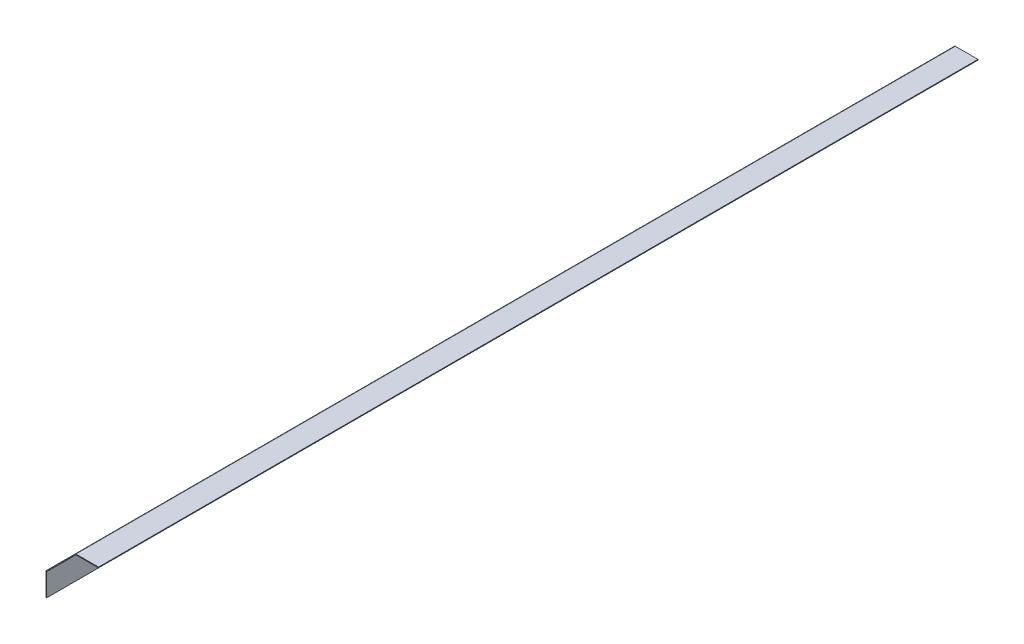
ISO-10303-21;
HEADER;
FILE_DESCRIPTION(('STEP AP214'),'2;1');
FILE_NAME('part.step','',(''),(''),'','','');
FILE_SCHEMA(('AUTOMOTIVE_DESIGN { 1 0 10303 214 1 1 1 1 }'));
ENDSEC;
DATA;
#1=APPLICATION_CONTEXT('core data for automotive mechanical design processes');
#2=APPLICATION_PROTOCOL_DEFINITION('international standard','automotive_design',2000,#1);
#3=PRODUCT_CONTEXT('',#1,'mechanical');
#4=PRODUCT('Part','Part','',(#3));
#5=PRODUCT_RELATED_PRODUCT_CATEGORY('part','',(#4));
#6=PRODUCT_DEFINITION_FORMATION('','',#4);
#7=PRODUCT_DEFINITION_CONTEXT('part definition',#1,'design');
#8=PRODUCT_DEFINITION('design','',#6,#7);
#9=PRODUCT_DEFINITION_SHAPE('','',#8);
#10=(LENGTH_UNIT() NAMED_UNIT(*) SI_UNIT(.MILLI.,.METRE.));
#11=(NAMED_UNIT(*) PLANE_ANGLE_UNIT() SI_UNIT($,.RADIAN.));
#12=(NAMED_UNIT(*) SI_UNIT($,.STERADIAN.) SOLID_ANGLE_UNIT());
#13=UNCERTAINTY_MEASURE_WITH_UNIT(LENGTH_MEASURE(1.E-05),#10,'distance_accuracy_value','');
#14=(GEOMETRIC_REPRESENTATION_CONTEXT(3) GLOBAL_UNCERTAINTY_ASSIGNED_CONTEXT((#13)) GLOBAL_UNIT_ASSIGNED_CONTEXT((#10,
#11,#12)) REPRESENTATION_CONTEXT('',''));
#15=CARTESIAN_POINT('',(0.,0.,0.));
#16=DIRECTION('',(0.,0.,1.));
#17=DIRECTION('',(1.,0.,0.));
#18=AXIS2_PLACEMENT_3D('',#15,#16,#17);
#19=CARTESIAN_POINT('',(0.43149028995598,25.431490289956,950.));
#20=DIRECTION('',(0.,0.,1.));
#21=DIRECTION('',(1.,0.,0.));
#22=AXIS2_PLACEMENT_3D('',#19,#20,#21);
#23=PLANE('',#22);
#24=DIRECTION('',(0.707106781186546,-0.707106781186549,0.));
#25=VECTOR('',#24,1.);
#26=CARTESIAN_POINT('',(0.43149028995598,25.431490289956,950.));
#27=LINE('',#26,#25);
#28=CARTESIAN_POINT('',(0.43149028995598,25.431490289956,950.));
#29=VERTEX_POINT('',#28);
#30=CARTESIAN_POINT('',(0.95234514497799,24.910635434934,950.));
#31=VERTEX_POINT('',#30);
#32=EDGE_CURVE('E11',#29,#31,#27,.T.);
#33=ORIENTED_EDGE('',*,*,#32,.F.);
#34=CARTESIAN_POINT('',(1.4732,24.389780579912,950.));
#35=DIRECTION('',(0.,0.,1.));
#36=DIRECTION('',(1.,0.,0.));
#37=AXIS2_PLACEMENT_3D('',#34,#35,#36);
#38=CIRCLE('',#37,1.4732);
#39=CARTESIAN_POINT('',(0.,24.389780579912,950.));
#40=VERTEX_POINT('',#39);
#41=EDGE_CURVE('E251',#40,#29,#38,.F.);
#42=ORIENTED_EDGE('',*,*,#41,.F.);
#43=DIRECTION('',(-1.,0.,0.));
#44=VECTOR('',#43,1.);
#45=CARTESIAN_POINT('',(0.736600000000001,24.389780579912,950.));
#46=LINE('',#45,#44);
#47=CARTESIAN_POINT('',(0.736600000000001,24.389780579912,950.));
#48=VERTEX_POINT('',#47);
#49=EDGE_CURVE('E49',#48,#40,#46,.T.);
#50=ORIENTED_EDGE('',*,*,#49,.F.);
#51=CARTESIAN_POINT('',(1.4732,24.389780579912,950.));
#52=DIRECTION('',(0.,0.,1.));
#53=DIRECTION('',(1.,0.,0.));
#54=AXIS2_PLACEMENT_3D('',#51,#52,#53);
#55=CIRCLE('',#54,0.7366);
#56=EDGE_CURVE('E150',#48,#31,#55,.F.);
#57=ORIENTED_EDGE('',*,*,#56,.T.);
#58=EDGE_LOOP('',(#33,#42,#50,#57));
#59=FACE_BOUND('',#58,.T.);
#60=ADVANCED_FACE('F41',(#59),#23,.T.);
#61=CARTESIAN_POINT('',(0.736600000000001,24.389780579912,950.));
#62=DIRECTION('',(0.,0.,1.));
#63=DIRECTION('',(1.,0.,0.));
#64=AXIS2_PLACEMENT_3D('',#61,#62,#63);
#65=PLANE('',#64);
#66=DIRECTION('',(0.707106781186549,0.707106781186546,0.));
#67=VECTOR('',#66,1.);
#68=CARTESIAN_POINT('',(0.,25.,950.));
#69=LINE('',#68,#67);
#70=CARTESIAN_POINT('',(31.3883148634387,56.3883148634386,950.));
#71=VERTEX_POINT('',#70);
#72=EDGE_CURVE('E144',#29,#71,#69,.T.);
#73=ORIENTED_EDGE('',*,*,#72,.F.);
#74=ORIENTED_EDGE('',*,*,#32,.T.);
#75=DIRECTION('',(0.707106781186549,0.707106781186546,0.));
#76=VECTOR('',#75,1.);
#77=CARTESIAN_POINT('',(0.52085485502201,24.479145144978,950.));
#78=LINE('',#77,#76);
#79=CARTESIAN_POINT('',(31.9091697184607,55.8674600084166,950.));
#80=VERTEX_POINT('',#79);
#81=EDGE_CURVE('E141',#31,#80,#78,.T.);
#82=ORIENTED_EDGE('',*,*,#81,.T.);
#83=DIRECTION('',(-0.707106781186543,0.707106781186552,0.));
#84=VECTOR('',#83,1.);
#85=CARTESIAN_POINT('',(31.9091697184607,55.8674600084166,950.));
#86=LINE('',#85,#84);
#87=EDGE_CURVE('E232',#80,#71,#86,.T.);
#88=ORIENTED_EDGE('',*,*,#87,.T.);
#89=EDGE_LOOP('',(#73,#74,#82,#88));
#90=FACE_BOUND('',#89,.T.);
#91=ADVANCED_FACE('F139',(#90),#65,.T.);
#92=CARTESIAN_POINT('',(0.,24.389780579912,0.));
#93=DIRECTION('',(0.,0.,-1.));
#94=DIRECTION('',(-1.,0.,0.));
#95=AXIS2_PLACEMENT_3D('',#92,#93,#94);
#96=PLANE('',#95);
#97=DIRECTION('',(1.,0.,0.));
#98=VECTOR('',#97,1.);
#99=CARTESIAN_POINT('',(0.,24.389780579912,0.));
#100=LINE('',#99,#98);
#101=CARTESIAN_POINT('',(0.,24.389780579912,0.));
#102=VERTEX_POINT('',#101);
#103=CARTESIAN_POINT('',(0.736600000000001,24.389780579912,0.));
#104=VERTEX_POINT('',#103);
#105=EDGE_CURVE('E237',#102,#104,#100,.T.);
#106=ORIENTED_EDGE('',*,*,#105,.F.);
#107=CARTESIAN_POINT('',(1.4732,24.389780579912,0.));
#108=DIRECTION('',(0.,0.,1.));
#109=DIRECTION('',(1.,0.,0.));
#110=AXIS2_PLACEMENT_3D('',#107,#108,#109);
#111=CIRCLE('',#110,1.4732);
#112=CARTESIAN_POINT('',(0.43149028995598,25.431490289956,0.));
#113=VERTEX_POINT('',#112);
#114=EDGE_CURVE('E189',#102,#113,#111,.F.);
#115=ORIENTED_EDGE('',*,*,#114,.T.);
#116=DIRECTION('',(-0.707106781186546,0.707106781186549,0.));
#117=VECTOR('',#116,1.);
#118=CARTESIAN_POINT('',(0.95234514497799,24.910635434934,0.));
#119=LINE('',#118,#117);
#120=CARTESIAN_POINT('',(0.95234514497799,24.910635434934,0.));
#121=VERTEX_POINT('',#120);
#122=EDGE_CURVE('E235',#121,#113,#119,.T.);
#123=ORIENTED_EDGE('',*,*,#122,.F.);
#124=CARTESIAN_POINT('',(1.4732,24.389780579912,0.));
#125=DIRECTION('',(0.,0.,1.));
#126=DIRECTION('',(1.,0.,0.));
#127=AXIS2_PLACEMENT_3D('',#124,#125,#126);
#128=CIRCLE('',#127,0.7366);
#129=EDGE_CURVE('E162',#104,#121,#128,.F.);
#130=ORIENTED_EDGE('',*,*,#129,.F.);
#131=EDGE_LOOP('',(#106,#115,#123,#130));
#132=FACE_BOUND('',#131,.T.);
#133=ADVANCED_FACE('F289',(#132),#96,.T.);
#134=CARTESIAN_POINT('',(0.95234514497799,24.910635434934,0.));
#135=DIRECTION('',(0.,0.,-1.));
#136=DIRECTION('',(-1.,0.,0.));
#137=AXIS2_PLACEMENT_3D('',#134,#135,#136);
#138=PLANE('',#137);
#139=DIRECTION('',(0.,1.,0.));
#140=VECTOR('',#139,1.);
#141=CARTESIAN_POINT('',(0.,0.,0.));
#142=LINE('',#141,#140);
#143=CARTESIAN_POINT('',(0.,0.,0.));
#144=VERTEX_POINT('',#143);
#145=EDGE_CURVE('E192',#144,#102,#142,.T.);
#146=ORIENTED_EDGE('',*,*,#145,.T.);
#147=ORIENTED_EDGE('',*,*,#105,.T.);
#148=DIRECTION('',(0.,1.,0.));
#149=VECTOR('',#148,1.);
#150=CARTESIAN_POINT('',(0.7366,0.,0.));
#151=LINE('',#150,#149);
#152=CARTESIAN_POINT('',(0.7366,0.,0.));
#153=VERTEX_POINT('',#152);
#154=EDGE_CURVE('E198',#153,#104,#151,.T.);
#155=ORIENTED_EDGE('',*,*,#154,.F.);
#156=DIRECTION('',(-1.,0.,0.));
#157=VECTOR('',#156,1.);
#158=CARTESIAN_POINT('',(0.7366,0.,0.));
#159=LINE('',#158,#157);
#160=EDGE_CURVE('E195',#153,#144,#159,.T.);
#161=ORIENTED_EDGE('',*,*,#160,.T.);
#162=EDGE_LOOP('',(#146,#147,#155,#161));
#163=FACE_BOUND('',#162,.T.);
#164=ADVANCED_FACE('F292',(#163),#138,.T.);
#165=CARTESIAN_POINT('',(32.4300245734827,56.8198051533946,950.));
#166=DIRECTION('',(0.,0.,1.));
#167=DIRECTION('',(1.,0.,0.));
#168=AXIS2_PLACEMENT_3D('',#165,#166,#167);
#169=PLANE('',#168);
#170=DIRECTION('',(0.,-1.,0.));
#171=VECTOR('',#170,1.);
#172=CARTESIAN_POINT('',(32.4300245734827,56.8198051533946,950.));
#173=LINE('',#172,#171);
#174=CARTESIAN_POINT('',(32.4300245734827,56.8198051533946,950.));
#175=VERTEX_POINT('',#174);
#176=CARTESIAN_POINT('',(32.4300245734827,56.0832051533946,950.));
#177=VERTEX_POINT('',#176);
#178=EDGE_CURVE('E57',#175,#177,#173,.T.);
#179=ORIENTED_EDGE('',*,*,#178,.F.);
#180=CARTESIAN_POINT('',(32.4300245734827,55.3466051533946,950.));
#181=DIRECTION('',(0.,0.,1.));
#182=DIRECTION('',(1.,0.,0.));
#183=AXIS2_PLACEMENT_3D('',#180,#181,#182);
#184=CIRCLE('',#183,1.4732);
#185=EDGE_CURVE('E261',#71,#175,#184,.F.);
#186=ORIENTED_EDGE('',*,*,#185,.F.);
#187=ORIENTED_EDGE('',*,*,#87,.F.);
#188=CARTESIAN_POINT('',(32.4300245734827,55.3466051533946,950.));
#189=DIRECTION('',(0.,0.,1.));
#190=DIRECTION('',(1.,0.,0.));
#191=AXIS2_PLACEMENT_3D('',#188,#189,#190);
#192=CIRCLE('',#191,0.7366);
#193=EDGE_CURVE('E170',#80,#177,#192,.F.);
#194=ORIENTED_EDGE('',*,*,#193,.T.);
#195=EDGE_LOOP('',(#179,#186,#187,#194));
#196=FACE_BOUND('',#195,.T.);
#197=ADVANCED_FACE('F284',(#196),#169,.T.);
#198=CARTESIAN_POINT('',(31.9091697184607,55.8674600084166,950.));
#199=DIRECTION('',(0.,0.,1.));
#200=DIRECTION('',(1.,0.,0.));
#201=AXIS2_PLACEMENT_3D('',#198,#199,#200);
#202=PLANE('',#201);
#203=DIRECTION('',(1.,0.,0.));
#204=VECTOR('',#203,1.);
#205=CARTESIAN_POINT('',(31.8198051533947,56.8198051533946,950.));
#206=LINE('',#205,#204);
#207=CARTESIAN_POINT('',(56.8198051533947,56.8198051533946,950.));
#208=VERTEX_POINT('',#207);
#209=EDGE_CURVE('E264',#175,#208,#206,.T.);
#210=ORIENTED_EDGE('',*,*,#209,.F.);
#211=ORIENTED_EDGE('',*,*,#178,.T.);
#212=DIRECTION('',(1.,0.,0.));
#213=VECTOR('',#212,1.);
#214=CARTESIAN_POINT('',(31.8198051533947,56.0832051533946,950.));
#215=LINE('',#214,#213);
#216=CARTESIAN_POINT('',(56.8198051533947,56.0832051533946,950.));
#217=VERTEX_POINT('',#216);
#218=EDGE_CURVE('E111',#177,#217,#215,.T.);
#219=ORIENTED_EDGE('',*,*,#218,.T.);
#220=DIRECTION('',(0.,-1.,0.));
#221=VECTOR('',#220,1.);
#222=CARTESIAN_POINT('',(56.8198051533947,56.8198051533946,950.));
#223=LINE('',#222,#221);
#224=EDGE_CURVE('E267',#208,#217,#223,.T.);
#225=ORIENTED_EDGE('',*,*,#224,.F.);
#226=EDGE_LOOP('',(#210,#211,#219,#225));
#227=FACE_BOUND('',#226,.T.);
#228=ADVANCED_FACE('F273',(#227),#202,.T.);
#229=CARTESIAN_POINT('',(31.3883148634387,56.3883148634386,0.));
#230=DIRECTION('',(0.,0.,-1.));
#231=DIRECTION('',(-1.,0.,0.));
#232=AXIS2_PLACEMENT_3D('',#229,#230,#231);
#233=PLANE('',#232);
#234=DIRECTION('',(0.707106781186543,-0.707106781186552,0.));
#235=VECTOR('',#234,1.);
#236=CARTESIAN_POINT('',(31.3883148634387,56.3883148634386,0.));
#237=LINE('',#236,#235);
#238=CARTESIAN_POINT('',(31.3883148634387,56.3883148634386,0.));
#239=VERTEX_POINT('',#238);
#240=CARTESIAN_POINT('',(31.9091697184607,55.8674600084166,0.));
#241=VERTEX_POINT('',#240);
#242=EDGE_CURVE('E98',#239,#241,#237,.T.);
#243=ORIENTED_EDGE('',*,*,#242,.F.);
#244=CARTESIAN_POINT('',(32.4300245734827,55.3466051533946,0.));
#245=DIRECTION('',(0.,0.,1.));
#246=DIRECTION('',(1.,0.,0.));
#247=AXIS2_PLACEMENT_3D('',#244,#245,#246);
#248=CIRCLE('',#247,1.4732);
#249=CARTESIAN_POINT('',(32.4300245734827,56.8198051533946,0.));
#250=VERTEX_POINT('',#249);
#251=EDGE_CURVE('E185',#239,#250,#248,.F.);
#252=ORIENTED_EDGE('',*,*,#251,.T.);
#253=DIRECTION('',(0.,1.,0.));
#254=VECTOR('',#253,1.);
#255=CARTESIAN_POINT('',(32.4300245734827,56.0832051533946,0.));
#256=LINE('',#255,#254);
#257=CARTESIAN_POINT('',(32.4300245734827,56.0832051533946,0.));
#258=VERTEX_POINT('',#257);
#259=EDGE_CURVE('E105',#258,#250,#256,.T.);
#260=ORIENTED_EDGE('',*,*,#259,.F.);
#261=CARTESIAN_POINT('',(32.4300245734827,55.3466051533946,0.));
#262=DIRECTION('',(0.,0.,1.));
#263=DIRECTION('',(1.,0.,0.));
#264=AXIS2_PLACEMENT_3D('',#261,#262,#263);
#265=CIRCLE('',#264,0.7366);
#266=EDGE_CURVE('E204',#241,#258,#265,.F.);
#267=ORIENTED_EDGE('',*,*,#266,.F.);
#268=EDGE_LOOP('',(#243,#252,#260,#267));
#269=FACE_BOUND('',#268,.T.);
#270=ADVANCED_FACE('F321',(#269),#233,.T.);
#271=CARTESIAN_POINT('',(32.4300245734827,56.0832051533946,0.));
#272=DIRECTION('',(0.,0.,-1.));
#273=DIRECTION('',(-1.,0.,0.));
#274=AXIS2_PLACEMENT_3D('',#271,#272,#273);
#275=PLANE('',#274);
#276=DIRECTION('',(0.707106781186549,0.707106781186546,0.));
#277=VECTOR('',#276,1.);
#278=CARTESIAN_POINT('',(0.,25.,0.));
#279=LINE('',#278,#277);
#280=EDGE_CURVE('E187',#113,#239,#279,.T.);
#281=ORIENTED_EDGE('',*,*,#280,.T.);
#282=ORIENTED_EDGE('',*,*,#242,.T.);
#283=DIRECTION('',(0.707106781186549,0.707106781186546,0.));
#284=VECTOR('',#283,1.);
#285=CARTESIAN_POINT('',(0.52085485502201,24.479145144978,0.));
#286=LINE('',#285,#284);
#287=EDGE_CURVE('E202',#121,#241,#286,.T.);
#288=ORIENTED_EDGE('',*,*,#287,.F.);
#289=ORIENTED_EDGE('',*,*,#122,.T.);
#290=EDGE_LOOP('',(#281,#282,#288,#289));
#291=FACE_BOUND('',#290,.T.);
#292=ADVANCED_FACE('F324',(#291),#275,.T.);
#293=CARTESIAN_POINT('',(31.8198051533947,56.0832051533946,950.));
#294=DIRECTION('',(0.,1.,0.));
#295=DIRECTION('',(0.,0.,1.));
#296=AXIS2_PLACEMENT_3D('',#293,#294,#295);
#297=PLANE('',#296);
#298=DIRECTION('',(1.,0.,0.));
#299=VECTOR('',#298,1.);
#300=CARTESIAN_POINT('',(31.8198051533947,56.0832051533946,0.));
#301=LINE('',#300,#299);
#302=CARTESIAN_POINT('',(56.8198051533947,56.0832051533946,0.));
#303=VERTEX_POINT('',#302);
#304=EDGE_CURVE('E176',#258,#303,#301,.T.);
#305=ORIENTED_EDGE('',*,*,#304,.T.);
#306=DIRECTION('',(0.,0.,-1.));
#307=VECTOR('',#306,1.);
#308=CARTESIAN_POINT('',(56.8198051533947,56.0832051533946,950.));
#309=LINE('',#308,#307);
#310=EDGE_CURVE('E228',#217,#303,#309,.T.);
#311=ORIENTED_EDGE('',*,*,#310,.F.);
#312=ORIENTED_EDGE('',*,*,#218,.F.);
#313=DIRECTION('',(0.,0.,-1.));
#314=VECTOR('',#313,1.);
#315=CARTESIAN_POINT('',(32.4300245734827,56.0832051533946,950.));
#316=LINE('',#315,#314);
#317=EDGE_CURVE('E172',#177,#258,#316,.T.);
#318=ORIENTED_EDGE('',*,*,#317,.T.);
#319=EDGE_LOOP('',(#305,#311,#312,#318));
#320=FACE_BOUND('',#319,.T.);
#321=ADVANCED_FACE('F327',(#320),#297,.F.);
#322=CARTESIAN_POINT('',(56.8198051533947,56.8198051533946,950.));
#323=DIRECTION('',(1.,0.,0.));
#324=DIRECTION('',(0.,0.,-1.));
#325=AXIS2_PLACEMENT_3D('',#322,#323,#324);
#326=PLANE('',#325);
#327=DIRECTION('',(0.,-1.,0.));
#328=VECTOR('',#327,1.);
#329=CARTESIAN_POINT('',(56.8198051533947,56.8198051533946,0.));
#330=LINE('',#329,#328);
#331=CARTESIAN_POINT('',(56.8198051533947,56.8198051533946,0.));
#332=VERTEX_POINT('',#331);
#333=EDGE_CURVE('E179',#332,#303,#330,.T.);
#334=ORIENTED_EDGE('',*,*,#333,.F.);
#335=DIRECTION('',(0.,0.,-1.));
#336=VECTOR('',#335,1.);
#337=CARTESIAN_POINT('',(56.8198051533947,56.8198051533946,950.));
#338=LINE('',#337,#336);
#339=EDGE_CURVE('E226',#208,#332,#338,.T.);
#340=ORIENTED_EDGE('',*,*,#339,.F.);
#341=ORIENTED_EDGE('',*,*,#224,.T.);
#342=ORIENTED_EDGE('',*,*,#310,.T.);
#343=EDGE_LOOP('',(#334,#340,#341,#342));
#344=FACE_BOUND('',#343,.T.);
#345=ADVANCED_FACE('F272',(#344),#326,.T.);
#346=CARTESIAN_POINT('',(31.8198051533947,56.8198051533946,950.));
#347=DIRECTION('',(0.,1.,0.));
#348=DIRECTION('',(0.,0.,1.));
#349=AXIS2_PLACEMENT_3D('',#346,#347,#348);
#350=PLANE('',#349);
#351=DIRECTION('',(1.,0.,0.));
#352=VECTOR('',#351,1.);
#353=CARTESIAN_POINT('',(31.8198051533947,56.8198051533946,0.));
#354=LINE('',#353,#352);
#355=EDGE_CURVE('E182',#250,#332,#354,.T.);
#356=ORIENTED_EDGE('',*,*,#355,.F.);
#357=DIRECTION('',(0.,0.,-1.));
#358=VECTOR('',#357,1.);
#359=CARTESIAN_POINT('',(32.4300245734827,56.8198051533946,950.));
#360=LINE('',#359,#358);
#361=EDGE_CURVE('E223',#175,#250,#360,.T.);
#362=ORIENTED_EDGE('',*,*,#361,.F.);
#363=ORIENTED_EDGE('',*,*,#209,.T.);
#364=ORIENTED_EDGE('',*,*,#339,.T.);
#365=EDGE_LOOP('',(#356,#362,#363,#364));
#366=FACE_BOUND('',#365,.T.);
#367=ADVANCED_FACE('F277',(#366),#350,.T.);
#368=CARTESIAN_POINT('',(32.4300245734827,55.3466051533946,950.));
#369=DIRECTION('',(0.,0.,-1.));
#370=DIRECTION('',(-1.,0.,0.));
#371=AXIS2_PLACEMENT_3D('',#368,#369,#370);
#372=CYLINDRICAL_SURFACE('',#371,1.4732);
#373=ORIENTED_EDGE('',*,*,#251,.F.);
#374=DIRECTION('',(0.,0.,-1.));
#375=VECTOR('',#374,1.);
#376=CARTESIAN_POINT('',(31.3883148634387,56.3883148634386,950.));
#377=LINE('',#376,#375);
#378=EDGE_CURVE('E220',#71,#239,#377,.T.);
#379=ORIENTED_EDGE('',*,*,#378,.F.);
#380=ORIENTED_EDGE('',*,*,#185,.T.);
#381=ORIENTED_EDGE('',*,*,#361,.T.);
#382=EDGE_LOOP('',(#373,#379,#380,#381));
#383=FACE_BOUND('',#382,.T.);
#384=ADVANCED_FACE('F280',(#383),#372,.T.);
#385=CARTESIAN_POINT('',(0.,25.,950.));
#386=DIRECTION('',(-0.707106781186546,0.707106781186549,0.));
#387=DIRECTION('',(-0.707106781186549,-0.707106781186546,0.));
#388=AXIS2_PLACEMENT_3D('',#385,#386,#387);
#389=PLANE('',#388);
#390=ORIENTED_EDGE('',*,*,#280,.F.);
#391=DIRECTION('',(0.,0.,-1.));
#392=VECTOR('',#391,1.);
#393=CARTESIAN_POINT('',(0.43149028995598,25.431490289956,950.));
#394=LINE('',#393,#392);
#395=EDGE_CURVE('E217',#29,#113,#394,.T.);
#396=ORIENTED_EDGE('',*,*,#395,.F.);
#397=ORIENTED_EDGE('',*,*,#72,.T.);
#398=ORIENTED_EDGE('',*,*,#378,.T.);
#399=EDGE_LOOP('',(#390,#396,#397,#398));
#400=FACE_BOUND('',#399,.T.);
#401=ADVANCED_FACE('F287',(#400),#389,.T.);
#402=CARTESIAN_POINT('',(1.4732,24.389780579912,950.));
#403=DIRECTION('',(0.,0.,-1.));
#404=DIRECTION('',(-1.,0.,0.));
#405=AXIS2_PLACEMENT_3D('',#402,#403,#404);
#406=CYLINDRICAL_SURFACE('',#405,1.4732);
#407=ORIENTED_EDGE('',*,*,#114,.F.);
#408=DIRECTION('',(0.,0.,-1.));
#409=VECTOR('',#408,1.);
#410=CARTESIAN_POINT('',(0.,24.389780579912,950.));
#411=LINE('',#410,#409);
#412=EDGE_CURVE('E214',#40,#102,#411,.T.);
#413=ORIENTED_EDGE('',*,*,#412,.F.);
#414=ORIENTED_EDGE('',*,*,#41,.T.);
#415=ORIENTED_EDGE('',*,*,#395,.T.);
#416=EDGE_LOOP('',(#407,#413,#414,#415));
#417=FACE_BOUND('',#416,.T.);
#418=ADVANCED_FACE('F250',(#417),#406,.T.);
#419=CARTESIAN_POINT('',(0.,0.,950.));
#420=DIRECTION('',(-1.,0.,0.));
#421=DIRECTION('',(0.,0.,1.));
#422=AXIS2_PLACEMENT_3D('',#419,#420,#421);
#423=PLANE('',#422);
#424=ORIENTED_EDGE('',*,*,#145,.F.);
#425=DIRECTION('',(0.,0.,-1.));
#426=VECTOR('',#425,1.);
#427=CARTESIAN_POINT('',(0.,0.,950.));
#428=LINE('',#427,#426);
#429=CARTESIAN_POINT('',(0.,0.,950.));
#430=VERTEX_POINT('',#429);
#431=EDGE_CURVE('E212',#430,#144,#428,.T.);
#432=ORIENTED_EDGE('',*,*,#431,.F.);
#433=DIRECTION('',(0.,1.,0.));
#434=VECTOR('',#433,1.);
#435=CARTESIAN_POINT('',(0.,0.,950.));
#436=LINE('',#435,#434);
#437=EDGE_CURVE('E244',#430,#40,#436,.T.);
#438=ORIENTED_EDGE('',*,*,#437,.T.);
#439=ORIENTED_EDGE('',*,*,#412,.T.);
#440=EDGE_LOOP('',(#424,#432,#438,#439));
#441=FACE_BOUND('',#440,.T.);
#442=ADVANCED_FACE('F255',(#441),#423,.T.);
#443=CARTESIAN_POINT('',(0.7366,0.,950.));
#444=DIRECTION('',(0.,-1.,0.));
#445=DIRECTION('',(0.,0.,-1.));
#446=AXIS2_PLACEMENT_3D('',#443,#444,#445);
#447=PLANE('',#446);
#448=ORIENTED_EDGE('',*,*,#160,.F.);
#449=DIRECTION('',(0.,0.,-1.));
#450=VECTOR('',#449,1.);
#451=CARTESIAN_POINT('',(0.7366,0.,950.));
#452=LINE('',#451,#450);
#453=CARTESIAN_POINT('',(0.7366,0.,950.));
#454=VERTEX_POINT('',#453);
#455=EDGE_CURVE('E210',#454,#153,#452,.T.);
#456=ORIENTED_EDGE('',*,*,#455,.F.);
#457=DIRECTION('',(-1.,0.,0.));
#458=VECTOR('',#457,1.);
#459=CARTESIAN_POINT('',(0.7366,0.,950.));
#460=LINE('',#459,#458);
#461=EDGE_CURVE('E256',#454,#430,#460,.T.);
#462=ORIENTED_EDGE('',*,*,#461,.T.);
#463=ORIENTED_EDGE('',*,*,#431,.T.);
#464=EDGE_LOOP('',(#448,#456,#462,#463));
#465=FACE_BOUND('',#464,.T.);
#466=ADVANCED_FACE('F297',(#465),#447,.T.);
#467=CARTESIAN_POINT('',(0.7366,0.,950.));
#468=DIRECTION('',(-1.,0.,0.));
#469=DIRECTION('',(0.,0.,1.));
#470=AXIS2_PLACEMENT_3D('',#467,#468,#469);
#471=PLANE('',#470);
#472=ORIENTED_EDGE('',*,*,#154,.T.);
#473=DIRECTION('',(0.,0.,-1.));
#474=VECTOR('',#473,1.);
#475=CARTESIAN_POINT('',(0.736600000000001,24.389780579912,950.));
#476=LINE('',#475,#474);
#477=EDGE_CURVE('E164',#48,#104,#476,.T.);
#478=ORIENTED_EDGE('',*,*,#477,.F.);
#479=DIRECTION('',(0.,1.,0.));
#480=VECTOR('',#479,1.);
#481=CARTESIAN_POINT('',(0.7366,0.,950.));
#482=LINE('',#481,#480);
#483=EDGE_CURVE('E155',#454,#48,#482,.T.);
#484=ORIENTED_EDGE('',*,*,#483,.F.);
#485=ORIENTED_EDGE('',*,*,#455,.T.);
#486=EDGE_LOOP('',(#472,#478,#484,#485));
#487=FACE_BOUND('',#486,.T.);
#488=ADVANCED_FACE('F295',(#487),#471,.F.);
#489=CARTESIAN_POINT('',(1.4732,24.389780579912,950.));
#490=DIRECTION('',(0.,0.,-1.));
#491=DIRECTION('',(-1.,0.,0.));
#492=AXIS2_PLACEMENT_3D('',#489,#490,#491);
#493=CYLINDRICAL_SURFACE('',#492,0.7366);
#494=ORIENTED_EDGE('',*,*,#129,.T.);
#495=DIRECTION('',(0.,0.,-1.));
#496=VECTOR('',#495,1.);
#497=CARTESIAN_POINT('',(0.95234514497799,24.910635434934,950.));
#498=LINE('',#497,#496);
#499=EDGE_CURVE('E159',#31,#121,#498,.T.);
#500=ORIENTED_EDGE('',*,*,#499,.F.);
#501=ORIENTED_EDGE('',*,*,#56,.F.);
#502=ORIENTED_EDGE('',*,*,#477,.T.);
#503=EDGE_LOOP('',(#494,#500,#501,#502));
#504=FACE_BOUND('',#503,.T.);
#505=ADVANCED_FACE('F160',(#504),#493,.F.);
#506=CARTESIAN_POINT('',(0.52085485502201,24.479145144978,950.));
#507=DIRECTION('',(-0.707106781186546,0.707106781186549,0.));
#508=DIRECTION('',(-0.707106781186549,-0.707106781186546,0.));
#509=AXIS2_PLACEMENT_3D('',#506,#507,#508);
#510=PLANE('',#509);
#511=ORIENTED_EDGE('',*,*,#287,.T.);
#512=DIRECTION('',(0.,0.,-1.));
#513=VECTOR('',#512,1.);
#514=CARTESIAN_POINT('',(31.9091697184607,55.8674600084166,950.));
#515=LINE('',#514,#513);
#516=EDGE_CURVE('E165',#80,#241,#515,.T.);
#517=ORIENTED_EDGE('',*,*,#516,.F.);
#518=ORIENTED_EDGE('',*,*,#81,.F.);
#519=ORIENTED_EDGE('',*,*,#499,.T.);
#520=EDGE_LOOP('',(#511,#517,#518,#519));
#521=FACE_BOUND('',#520,.T.);
#522=ADVANCED_FACE('F167',(#521),#510,.F.);
#523=CARTESIAN_POINT('',(32.4300245734827,55.3466051533946,950.));
#524=DIRECTION('',(0.,0.,-1.));
#525=DIRECTION('',(-1.,0.,0.));
#526=AXIS2_PLACEMENT_3D('',#523,#524,#525);
#527=CYLINDRICAL_SURFACE('',#526,0.7366);
#528=ORIENTED_EDGE('',*,*,#266,.T.);
#529=ORIENTED_EDGE('',*,*,#317,.F.);
#530=ORIENTED_EDGE('',*,*,#193,.F.);
#531=ORIENTED_EDGE('',*,*,#516,.T.);
#532=EDGE_LOOP('',(#528,#529,#530,#531));
#533=FACE_BOUND('',#532,.T.);
#534=ADVANCED_FACE('F379',(#533),#527,.F.);
#535=CARTESIAN_POINT('',(32.4300245734827,55.3466051533946,950.));
#536=DIRECTION('',(0.,0.,1.));
#537=DIRECTION('',(1.,0.,0.));
#538=AXIS2_PLACEMENT_3D('',#535,#536,#537);
#539=PLANE('',#538);
#540=ORIENTED_EDGE('',*,*,#483,.T.);
#541=ORIENTED_EDGE('',*,*,#49,.T.);
#542=ORIENTED_EDGE('',*,*,#437,.F.);
#543=ORIENTED_EDGE('',*,*,#461,.F.);
#544=EDGE_LOOP('',(#540,#541,#542,#543));
#545=FACE_BOUND('',#544,.T.);
#546=ADVANCED_FACE('F241',(#545),#539,.T.);
#547=CARTESIAN_POINT('',(32.4300245734827,55.3466051533946,0.));
#548=DIRECTION('',(0.,0.,1.));
#549=DIRECTION('',(1.,0.,0.));
#550=AXIS2_PLACEMENT_3D('',#547,#548,#549);
#551=PLANE('',#550);
#552=ORIENTED_EDGE('',*,*,#304,.F.);
#553=ORIENTED_EDGE('',*,*,#259,.T.);
#554=ORIENTED_EDGE('',*,*,#355,.T.);
#555=ORIENTED_EDGE('',*,*,#333,.T.);
#556=EDGE_LOOP('',(#552,#553,#554,#555));
#557=FACE_BOUND('',#556,.T.);
#558=ADVANCED_FACE('F399',(#557),#551,.F.);
#559=CLOSED_SHELL('',(#60,#91,#133,#164,#197,#228,#270,#292,#321,#345,#367,#384,#401,#418,#442,
#466,#488,#505,#522,#534,#546,#558));
#560=MANIFOLD_SOLID_BREP('B2',#559);
#561=ADVANCED_BREP_SHAPE_REPRESENTATION('',(#18,#560),#14);
#562=SHAPE_DEFINITION_REPRESENTATION(#9,#561);
ENDSEC;
END-ISO-10303-21;
